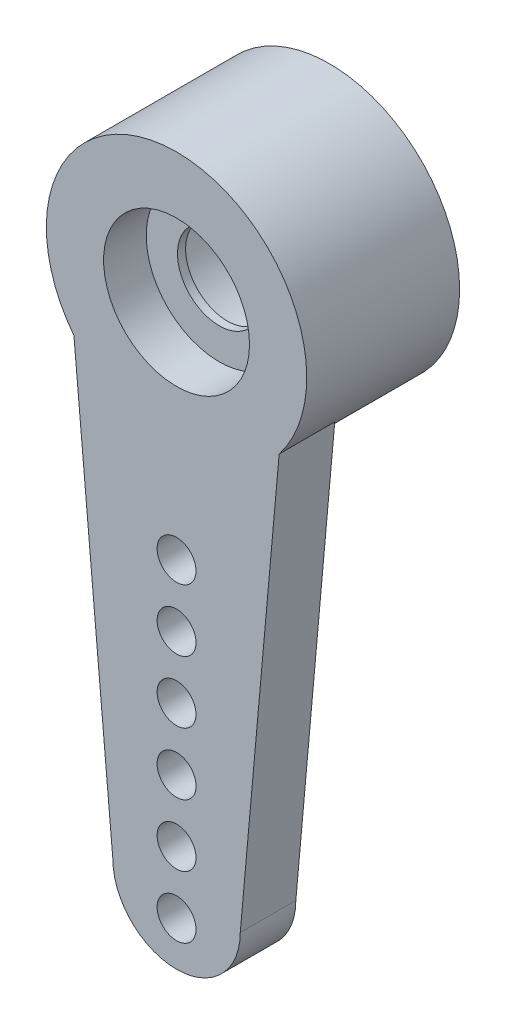
ISO-10303-21;
HEADER;
FILE_DESCRIPTION(('STEP AP214'),'2;1');
FILE_NAME('part.step','',(''),(''),'','','');
FILE_SCHEMA(('AUTOMOTIVE_DESIGN { 1 0 10303 214 1 1 1 1 }'));
ENDSEC;
DATA;
#1=APPLICATION_CONTEXT('core data for automotive mechanical design processes');
#2=APPLICATION_PROTOCOL_DEFINITION('international standard','automotive_design',2000,#1);
#3=PRODUCT_CONTEXT('',#1,'mechanical');
#4=PRODUCT('Part','Part','',(#3));
#5=PRODUCT_RELATED_PRODUCT_CATEGORY('part','',(#4));
#6=PRODUCT_DEFINITION_FORMATION('','',#4);
#7=PRODUCT_DEFINITION_CONTEXT('part definition',#1,'design');
#8=PRODUCT_DEFINITION('design','',#6,#7);
#9=PRODUCT_DEFINITION_SHAPE('','',#8);
#10=(LENGTH_UNIT() NAMED_UNIT(*) SI_UNIT(.MILLI.,.METRE.));
#11=(NAMED_UNIT(*) PLANE_ANGLE_UNIT() SI_UNIT($,.RADIAN.));
#12=(NAMED_UNIT(*) SI_UNIT($,.STERADIAN.) SOLID_ANGLE_UNIT());
#13=UNCERTAINTY_MEASURE_WITH_UNIT(LENGTH_MEASURE(1.E-05),#10,'distance_accuracy_value','');
#14=(GEOMETRIC_REPRESENTATION_CONTEXT(3) GLOBAL_UNCERTAINTY_ASSIGNED_CONTEXT((#13)) GLOBAL_UNIT_ASSIGNED_CONTEXT((#10,
#11,#12)) REPRESENTATION_CONTEXT('',''));
#15=CARTESIAN_POINT('',(0.,0.,0.));
#16=DIRECTION('',(0.,0.,1.));
#17=DIRECTION('',(1.,0.,0.));
#18=AXIS2_PLACEMENT_3D('',#15,#16,#17);
#19=CARTESIAN_POINT('',(-5.49999999999997,0.,-2.84196586235089));
#20=DIRECTION('',(0.,0.,-1.));
#21=DIRECTION('',(-1.,0.,0.));
#22=AXIS2_PLACEMENT_3D('',#19,#20,#21);
#23=CYLINDRICAL_SURFACE('',#22,2.);
#24=CARTESIAN_POINT('',(-5.49999999999997,0.,-7.03296586235089));
#25=DIRECTION('',(0.,0.,1.));
#26=DIRECTION('',(1.,0.,0.));
#27=AXIS2_PLACEMENT_3D('',#24,#25,#26);
#28=CIRCLE('',#27,2.);
#29=CARTESIAN_POINT('',(-3.49999999999996,0.,-7.03296586235089));
#30=VERTEX_POINT('',#29);
#31=EDGE_CURVE('E111',#30,#30,#28,.T.);
#32=ORIENTED_EDGE('',*,*,#31,.F.);
#33=EDGE_LOOP('',(#32));
#34=FACE_BOUND('',#33,.T.);
#35=CARTESIAN_POINT('',(-5.49999999999997,0.,-4.23296586235089));
#36=DIRECTION('',(0.,0.,1.));
#37=DIRECTION('',(1.,0.,0.));
#38=AXIS2_PLACEMENT_3D('',#35,#36,#37);
#39=CIRCLE('',#38,2.00000000000001);
#40=CARTESIAN_POINT('',(-3.49999999999996,0.,-4.23296586235089));
#41=VERTEX_POINT('',#40);
#42=EDGE_CURVE('E107',#41,#41,#39,.T.);
#43=ORIENTED_EDGE('',*,*,#42,.T.);
#44=EDGE_LOOP('',(#43));
#45=FACE_BOUND('',#44,.T.);
#46=ADVANCED_FACE('F34',(#34,#45),#23,.F.);
#47=CARTESIAN_POINT('',(-5.49999999999997,0.,-2.84196586235089));
#48=DIRECTION('',(0.,0.,1.));
#49=DIRECTION('',(1.,0.,0.));
#50=AXIS2_PLACEMENT_3D('',#47,#48,#49);
#51=PLANE('',#50);
#52=CARTESIAN_POINT('',(-5.49999999999997,0.,-2.84196586235089));
#53=DIRECTION('',(0.,0.,1.));
#54=DIRECTION('',(1.,0.,0.));
#55=AXIS2_PLACEMENT_3D('',#52,#53,#54);
#56=CIRCLE('',#55,3.5687);
#57=CARTESIAN_POINT('',(-2.68694999999995,-2.19598938692788,-2.84196586235089));
#58=VERTEX_POINT('',#57);
#59=CARTESIAN_POINT('',(-8.31304999999995,-2.1959893869279,-2.84196586235089));
#60=VERTEX_POINT('',#59);
#61=EDGE_CURVE('E42',#58,#60,#56,.T.);
#62=ORIENTED_EDGE('',*,*,#61,.T.);
#63=DIRECTION('',(0.0893287482023586,-0.996002196154506,0.));
#64=VECTOR('',#63,1.);
#65=CARTESIAN_POINT('',(-7.24624999999995,-14.09065,-2.84196586235089));
#66=LINE('',#65,#64);
#67=CARTESIAN_POINT('',(-7.24624999999995,-14.09065,-2.84196586235089));
#68=VERTEX_POINT('',#67);
#69=EDGE_CURVE('E195',#60,#68,#66,.T.);
#70=ORIENTED_EDGE('',*,*,#69,.T.);
#71=CARTESIAN_POINT('',(-5.49999999999995,-14.09065,-2.84196586235089));
#72=DIRECTION('',(0.,0.,1.));
#73=DIRECTION('',(1.,0.,0.));
#74=AXIS2_PLACEMENT_3D('',#71,#72,#73);
#75=CIRCLE('',#74,1.74625);
#76=CARTESIAN_POINT('',(-3.75374999999995,-14.09065,-2.84196586235089));
#77=VERTEX_POINT('',#76);
#78=EDGE_CURVE('E189',#68,#77,#75,.T.);
#79=ORIENTED_EDGE('',*,*,#78,.T.);
#80=DIRECTION('',(0.0893287482023584,0.996002196154506,0.));
#81=VECTOR('',#80,1.);
#82=CARTESIAN_POINT('',(-3.75374999999995,-14.09065,-2.84196586235089));
#83=LINE('',#82,#81);
#84=EDGE_CURVE('E49',#77,#58,#83,.T.);
#85=ORIENTED_EDGE('',*,*,#84,.T.);
#86=EDGE_LOOP('',(#62,#70,#79,#85));
#87=FACE_BOUND('',#86,.T.);
#88=CARTESIAN_POINT('',(-5.49999999999997,0.,-2.84196586235089));
#89=DIRECTION('',(0.,0.,1.));
#90=DIRECTION('',(1.,0.,0.));
#91=AXIS2_PLACEMENT_3D('',#88,#89,#90);
#92=CIRCLE('',#91,2.);
#93=CARTESIAN_POINT('',(-3.49999999999996,0.,-2.84196586235089));
#94=VERTEX_POINT('',#93);
#95=EDGE_CURVE('E114',#94,#94,#92,.T.);
#96=ORIENTED_EDGE('',*,*,#95,.F.);
#97=EDGE_LOOP('',(#96));
#98=FACE_BOUND('',#97,.T.);
#99=CARTESIAN_POINT('',(-5.49999999999998,-6.11505,-2.84196586235089));
#100=DIRECTION('',(0.,0.,1.));
#101=DIRECTION('',(1.,0.,0.));
#102=AXIS2_PLACEMENT_3D('',#99,#100,#101);
#103=CIRCLE('',#102,0.533399999999999);
#104=CARTESIAN_POINT('',(-4.96659999999998,-6.11505,-2.84196586235089));
#105=VERTEX_POINT('',#104);
#106=EDGE_CURVE('E164',#105,#105,#103,.T.);
#107=ORIENTED_EDGE('',*,*,#106,.F.);
#108=EDGE_LOOP('',(#107));
#109=FACE_BOUND('',#108,.T.);
#110=CARTESIAN_POINT('',(-5.49999999999997,-7.81685,-2.84196586235089));
#111=DIRECTION('',(0.,0.,1.));
#112=DIRECTION('',(1.,0.,0.));
#113=AXIS2_PLACEMENT_3D('',#110,#111,#112);
#114=CIRCLE('',#113,0.533399999999999);
#115=CARTESIAN_POINT('',(-4.96659999999998,-7.81685,-2.84196586235089));
#116=VERTEX_POINT('',#115);
#117=EDGE_CURVE('E168',#116,#116,#114,.T.);
#118=ORIENTED_EDGE('',*,*,#117,.F.);
#119=EDGE_LOOP('',(#118));
#120=FACE_BOUND('',#119,.T.);
#121=CARTESIAN_POINT('',(-5.49999999999997,-9.51865,-2.84196586235089));
#122=DIRECTION('',(0.,0.,1.));
#123=DIRECTION('',(1.,0.,0.));
#124=AXIS2_PLACEMENT_3D('',#121,#122,#123);
#125=CIRCLE('',#124,0.5334);
#126=CARTESIAN_POINT('',(-4.96659999999997,-9.51865,-2.84196586235089));
#127=VERTEX_POINT('',#126);
#128=EDGE_CURVE('E172',#127,#127,#125,.T.);
#129=ORIENTED_EDGE('',*,*,#128,.F.);
#130=EDGE_LOOP('',(#129));
#131=FACE_BOUND('',#130,.T.);
#132=CARTESIAN_POINT('',(-5.49999999999996,-11.22045,-2.84196586235089));
#133=DIRECTION('',(0.,0.,1.));
#134=DIRECTION('',(1.,0.,0.));
#135=AXIS2_PLACEMENT_3D('',#132,#133,#134);
#136=CIRCLE('',#135,0.5334);
#137=CARTESIAN_POINT('',(-4.96659999999996,-11.22045,-2.84196586235089));
#138=VERTEX_POINT('',#137);
#139=EDGE_CURVE('E176',#138,#138,#136,.T.);
#140=ORIENTED_EDGE('',*,*,#139,.F.);
#141=EDGE_LOOP('',(#140));
#142=FACE_BOUND('',#141,.T.);
#143=CARTESIAN_POINT('',(-5.49999999999996,-12.92225,-2.84196586235089));
#144=DIRECTION('',(0.,0.,1.));
#145=DIRECTION('',(1.,0.,0.));
#146=AXIS2_PLACEMENT_3D('',#143,#144,#145);
#147=CIRCLE('',#146,0.5334);
#148=CARTESIAN_POINT('',(-4.96659999999996,-12.92225,-2.84196586235089));
#149=VERTEX_POINT('',#148);
#150=EDGE_CURVE('E180',#149,#149,#147,.T.);
#151=ORIENTED_EDGE('',*,*,#150,.F.);
#152=EDGE_LOOP('',(#151));
#153=FACE_BOUND('',#152,.T.);
#154=CARTESIAN_POINT('',(-5.49999999999995,-14.62405,-2.84196586235089));
#155=DIRECTION('',(0.,0.,1.));
#156=DIRECTION('',(1.,0.,0.));
#157=AXIS2_PLACEMENT_3D('',#154,#155,#156);
#158=CIRCLE('',#157,0.5334);
#159=CARTESIAN_POINT('',(-4.96659999999995,-14.62405,-2.84196586235089));
#160=VERTEX_POINT('',#159);
#161=EDGE_CURVE('E183',#160,#160,#158,.T.);
#162=ORIENTED_EDGE('',*,*,#161,.F.);
#163=EDGE_LOOP('',(#162));
#164=FACE_BOUND('',#163,.T.);
#165=ADVANCED_FACE('F126',(#87,#98,#109,#120,#131,#142,#153,#164),#51,.T.);
#166=CARTESIAN_POINT('',(-5.49999999999997,0.,-7.03296586235089));
#167=DIRECTION('',(0.,0.,1.));
#168=DIRECTION('',(1.,0.,0.));
#169=AXIS2_PLACEMENT_3D('',#166,#167,#168);
#170=PLANE('',#169);
#171=CARTESIAN_POINT('',(-5.49999999999997,0.,-7.03296586235089));
#172=DIRECTION('',(0.,0.,1.));
#173=DIRECTION('',(1.,0.,0.));
#174=AXIS2_PLACEMENT_3D('',#171,#172,#173);
#175=CIRCLE('',#174,3.5687);
#176=CARTESIAN_POINT('',(-1.93129999999997,0.,-7.03296586235089));
#177=VERTEX_POINT('',#176);
#178=EDGE_CURVE('E117',#177,#177,#175,.T.);
#179=ORIENTED_EDGE('',*,*,#178,.F.);
#180=EDGE_LOOP('',(#179));
#181=FACE_BOUND('',#180,.T.);
#182=ORIENTED_EDGE('',*,*,#31,.T.);
#183=EDGE_LOOP('',(#182));
#184=FACE_BOUND('',#183,.T.);
#185=ADVANCED_FACE('F123',(#181,#184),#170,.F.);
#186=CARTESIAN_POINT('',(-5.49999999999997,0.,-2.84196586235089));
#187=DIRECTION('',(0.,0.,-1.));
#188=DIRECTION('',(-1.,0.,0.));
#189=AXIS2_PLACEMENT_3D('',#186,#187,#188);
#190=CYLINDRICAL_SURFACE('',#189,3.5687);
#191=CARTESIAN_POINT('',(-5.49999999999995,0.,-4.36596586235089));
#192=DIRECTION('',(0.,0.,-1.));
#193=DIRECTION('',(-1.,0.,0.));
#194=AXIS2_PLACEMENT_3D('',#191,#192,#193);
#195=CIRCLE('',#194,3.5687);
#196=CARTESIAN_POINT('',(-2.68694999999995,-2.1959893869279,-4.36596586235089));
#197=VERTEX_POINT('',#196);
#198=CARTESIAN_POINT('',(-8.31304999999995,-2.1959893869279,-4.36596586235089));
#199=VERTEX_POINT('',#198);
#200=EDGE_CURVE('E84',#197,#199,#195,.T.);
#201=ORIENTED_EDGE('',*,*,#200,.T.);
#202=DIRECTION('',(0.,0.,1.));
#203=VECTOR('',#202,1.);
#204=CARTESIAN_POINT('',(-8.31304999999995,-2.1959893869279,-4.36596586235089));
#205=LINE('',#204,#203);
#206=EDGE_CURVE('E98',#199,#60,#205,.T.);
#207=ORIENTED_EDGE('',*,*,#206,.T.);
#208=ORIENTED_EDGE('',*,*,#61,.F.);
#209=DIRECTION('',(0.,0.,1.));
#210=VECTOR('',#209,1.);
#211=CARTESIAN_POINT('',(-2.68694999999995,-2.1959893869279,-4.36596586235089));
#212=LINE('',#211,#210);
#213=EDGE_CURVE('E93',#197,#58,#212,.T.);
#214=ORIENTED_EDGE('',*,*,#213,.F.);
#215=EDGE_LOOP('',(#201,#207,#208,#214));
#216=FACE_BOUND('',#215,.T.);
#217=ORIENTED_EDGE('',*,*,#178,.T.);
#218=EDGE_LOOP('',(#217));
#219=FACE_BOUND('',#218,.T.);
#220=ADVANCED_FACE('F36',(#216,#219),#190,.T.);
#221=CARTESIAN_POINT('',(-5.49999999999997,0.,-4.01036586235089));
#222=DIRECTION('',(0.,0.,1.));
#223=DIRECTION('',(1.,0.,0.));
#224=AXIS2_PLACEMENT_3D('',#221,#222,#223);
#225=CIRCLE('',#224,2.);
#226=CARTESIAN_POINT('',(-3.49999999999996,0.,-4.01036586235089));
#227=VERTEX_POINT('',#226);
#228=EDGE_CURVE('E12',#227,#227,#225,.T.);
#229=ORIENTED_EDGE('',*,*,#228,.F.);
#230=EDGE_LOOP('',(#229));
#231=FACE_BOUND('',#230,.T.);
#232=ORIENTED_EDGE('',*,*,#95,.T.);
#233=EDGE_LOOP('',(#232));
#234=FACE_BOUND('',#233,.T.);
#235=ADVANCED_FACE('F132',(#231,#234),#23,.F.);
#236=CARTESIAN_POINT('',(-5.49999999999997,0.,-4.23296586235089));
#237=DIRECTION('',(0.,0.,1.));
#238=DIRECTION('',(1.,0.,0.));
#239=AXIS2_PLACEMENT_3D('',#236,#237,#238);
#240=PLANE('',#239);
#241=ORIENTED_EDGE('',*,*,#42,.F.);
#242=EDGE_LOOP('',(#241));
#243=FACE_BOUND('',#242,.T.);
#244=CARTESIAN_POINT('',(-5.49999999999997,0.,-4.23296586235089));
#245=DIRECTION('',(0.,0.,1.));
#246=DIRECTION('',(1.,0.,0.));
#247=AXIS2_PLACEMENT_3D('',#244,#245,#246);
#248=CIRCLE('',#247,1.14300000000001);
#249=CARTESIAN_POINT('',(-4.35699999999996,0.,-4.23296586235089));
#250=VERTEX_POINT('',#249);
#251=EDGE_CURVE('E104',#250,#250,#248,.T.);
#252=ORIENTED_EDGE('',*,*,#251,.T.);
#253=EDGE_LOOP('',(#252));
#254=FACE_BOUND('',#253,.T.);
#255=ADVANCED_FACE('F135',(#243,#254),#240,.F.);
#256=CARTESIAN_POINT('',(-5.49999999999997,0.,2.81488838714151));
#257=DIRECTION('',(0.,0.,-1.));
#258=DIRECTION('',(-1.,0.,0.));
#259=AXIS2_PLACEMENT_3D('',#256,#257,#258);
#260=CYLINDRICAL_SURFACE('',#259,1.14300000000001);
#261=ORIENTED_EDGE('',*,*,#251,.F.);
#262=EDGE_LOOP('',(#261));
#263=FACE_BOUND('',#262,.T.);
#264=CARTESIAN_POINT('',(-5.49999999999997,0.,-4.01036586235089));
#265=DIRECTION('',(0.,0.,1.));
#266=DIRECTION('',(1.,0.,0.));
#267=AXIS2_PLACEMENT_3D('',#264,#265,#266);
#268=CIRCLE('',#267,1.14300000000001);
#269=CARTESIAN_POINT('',(-4.35699999999996,0.,-4.01036586235089));
#270=VERTEX_POINT('',#269);
#271=EDGE_CURVE('E108',#270,#270,#268,.T.);
#272=ORIENTED_EDGE('',*,*,#271,.T.);
#273=EDGE_LOOP('',(#272));
#274=FACE_BOUND('',#273,.T.);
#275=ADVANCED_FACE('F138',(#263,#274),#260,.F.);
#276=CARTESIAN_POINT('',(-5.49999999999997,0.,-4.01036586235089));
#277=DIRECTION('',(0.,0.,1.));
#278=DIRECTION('',(1.,0.,0.));
#279=AXIS2_PLACEMENT_3D('',#276,#277,#278);
#280=PLANE('',#279);
#281=ORIENTED_EDGE('',*,*,#271,.F.);
#282=EDGE_LOOP('',(#281));
#283=FACE_BOUND('',#282,.T.);
#284=ORIENTED_EDGE('',*,*,#228,.T.);
#285=EDGE_LOOP('',(#284));
#286=FACE_BOUND('',#285,.T.);
#287=ADVANCED_FACE('F144',(#283,#286),#280,.T.);
#288=CARTESIAN_POINT('',(-5.49999999999995,-14.09065,-4.36596586235089));
#289=DIRECTION('',(0.,0.,1.));
#290=DIRECTION('',(1.,0.,0.));
#291=AXIS2_PLACEMENT_3D('',#288,#289,#290);
#292=CYLINDRICAL_SURFACE('',#291,1.74625);
#293=ORIENTED_EDGE('',*,*,#78,.F.);
#294=DIRECTION('',(0.,0.,1.));
#295=VECTOR('',#294,1.);
#296=CARTESIAN_POINT('',(-7.24624999999995,-14.09065,-4.36596586235089));
#297=LINE('',#296,#295);
#298=CARTESIAN_POINT('',(-7.24624999999995,-14.09065,-4.36596586235089));
#299=VERTEX_POINT('',#298);
#300=EDGE_CURVE('E58',#299,#68,#297,.T.);
#301=ORIENTED_EDGE('',*,*,#300,.F.);
#302=CARTESIAN_POINT('',(-5.49999999999995,-14.09065,-4.36596586235089));
#303=DIRECTION('',(0.,0.,1.));
#304=DIRECTION('',(1.,0.,0.));
#305=AXIS2_PLACEMENT_3D('',#302,#303,#304);
#306=CIRCLE('',#305,1.74625);
#307=CARTESIAN_POINT('',(-3.75374999999995,-14.09065,-4.36596586235089));
#308=VERTEX_POINT('',#307);
#309=EDGE_CURVE('E95',#299,#308,#306,.T.);
#310=ORIENTED_EDGE('',*,*,#309,.T.);
#311=DIRECTION('',(0.,0.,1.));
#312=VECTOR('',#311,1.);
#313=CARTESIAN_POINT('',(-3.75374999999995,-14.09065,-4.36596586235089));
#314=LINE('',#313,#312);
#315=EDGE_CURVE('E78',#308,#77,#314,.T.);
#316=ORIENTED_EDGE('',*,*,#315,.T.);
#317=EDGE_LOOP('',(#293,#301,#310,#316));
#318=FACE_BOUND('',#317,.T.);
#319=ADVANCED_FACE('F150',(#318),#292,.T.);
#320=CARTESIAN_POINT('',(-7.24624999999995,-14.09065,-4.36596586235089));
#321=DIRECTION('',(-0.996002196154506,-0.0893287482023586,0.));
#322=DIRECTION('',(0.0893287482023586,-0.996002196154506,0.));
#323=AXIS2_PLACEMENT_3D('',#320,#321,#322);
#324=PLANE('',#323);
#325=ORIENTED_EDGE('',*,*,#69,.F.);
#326=ORIENTED_EDGE('',*,*,#206,.F.);
#327=DIRECTION('',(0.0893287482023586,-0.996002196154506,0.));
#328=VECTOR('',#327,1.);
#329=CARTESIAN_POINT('',(-7.24624999999995,-14.09065,-4.36596586235089));
#330=LINE('',#329,#328);
#331=EDGE_CURVE('E87',#199,#299,#330,.T.);
#332=ORIENTED_EDGE('',*,*,#331,.T.);
#333=ORIENTED_EDGE('',*,*,#300,.T.);
#334=EDGE_LOOP('',(#325,#326,#332,#333));
#335=FACE_BOUND('',#334,.T.);
#336=ADVANCED_FACE('F201',(#335),#324,.T.);
#337=CARTESIAN_POINT('',(-3.75374999999995,-14.09065,-4.36596586235089));
#338=DIRECTION('',(0.996002196154506,-0.0893287482023584,0.));
#339=DIRECTION('',(0.0893287482023584,0.996002196154506,0.));
#340=AXIS2_PLACEMENT_3D('',#337,#338,#339);
#341=PLANE('',#340);
#342=ORIENTED_EDGE('',*,*,#84,.F.);
#343=ORIENTED_EDGE('',*,*,#315,.F.);
#344=DIRECTION('',(0.0893287482023584,0.996002196154506,0.));
#345=VECTOR('',#344,1.);
#346=CARTESIAN_POINT('',(-3.75374999999995,-14.09065,-4.36596586235089));
#347=LINE('',#346,#345);
#348=EDGE_CURVE('E86',#308,#197,#347,.T.);
#349=ORIENTED_EDGE('',*,*,#348,.T.);
#350=ORIENTED_EDGE('',*,*,#213,.T.);
#351=EDGE_LOOP('',(#342,#343,#349,#350));
#352=FACE_BOUND('',#351,.T.);
#353=ADVANCED_FACE('F92',(#352),#341,.T.);
#354=CARTESIAN_POINT('',(-5.49999999999995,-14.09065,-4.36596586235089));
#355=DIRECTION('',(0.,0.,1.));
#356=DIRECTION('',(1.,0.,0.));
#357=AXIS2_PLACEMENT_3D('',#354,#355,#356);
#358=PLANE('',#357);
#359=CARTESIAN_POINT('',(-5.49999999999998,-6.11505,-4.36596586235089));
#360=DIRECTION('',(0.,0.,1.));
#361=DIRECTION('',(1.,0.,0.));
#362=AXIS2_PLACEMENT_3D('',#359,#360,#361);
#363=CIRCLE('',#362,0.533399999999999);
#364=CARTESIAN_POINT('',(-4.96659999999998,-6.11505,-4.36596586235089));
#365=VERTEX_POINT('',#364);
#366=EDGE_CURVE('E242',#365,#365,#363,.T.);
#367=ORIENTED_EDGE('',*,*,#366,.T.);
#368=EDGE_LOOP('',(#367));
#369=FACE_BOUND('',#368,.T.);
#370=CARTESIAN_POINT('',(-5.49999999999997,-7.81685,-4.36596586235089));
#371=DIRECTION('',(0.,0.,1.));
#372=DIRECTION('',(1.,0.,0.));
#373=AXIS2_PLACEMENT_3D('',#370,#371,#372);
#374=CIRCLE('',#373,0.533399999999999);
#375=CARTESIAN_POINT('',(-4.96659999999998,-7.81685,-4.36596586235089));
#376=VERTEX_POINT('',#375);
#377=EDGE_CURVE('E246',#376,#376,#374,.T.);
#378=ORIENTED_EDGE('',*,*,#377,.T.);
#379=EDGE_LOOP('',(#378));
#380=FACE_BOUND('',#379,.T.);
#381=CARTESIAN_POINT('',(-5.49999999999997,-9.51865,-4.36596586235089));
#382=DIRECTION('',(0.,0.,1.));
#383=DIRECTION('',(1.,0.,0.));
#384=AXIS2_PLACEMENT_3D('',#381,#382,#383);
#385=CIRCLE('',#384,0.5334);
#386=CARTESIAN_POINT('',(-4.96659999999997,-9.51865,-4.36596586235089));
#387=VERTEX_POINT('',#386);
#388=EDGE_CURVE('E250',#387,#387,#385,.T.);
#389=ORIENTED_EDGE('',*,*,#388,.T.);
#390=EDGE_LOOP('',(#389));
#391=FACE_BOUND('',#390,.T.);
#392=CARTESIAN_POINT('',(-5.49999999999996,-11.22045,-4.36596586235089));
#393=DIRECTION('',(0.,0.,1.));
#394=DIRECTION('',(1.,0.,0.));
#395=AXIS2_PLACEMENT_3D('',#392,#393,#394);
#396=CIRCLE('',#395,0.5334);
#397=CARTESIAN_POINT('',(-4.96659999999996,-11.22045,-4.36596586235089));
#398=VERTEX_POINT('',#397);
#399=EDGE_CURVE('E254',#398,#398,#396,.T.);
#400=ORIENTED_EDGE('',*,*,#399,.T.);
#401=EDGE_LOOP('',(#400));
#402=FACE_BOUND('',#401,.T.);
#403=CARTESIAN_POINT('',(-5.49999999999996,-12.92225,-4.36596586235089));
#404=DIRECTION('',(0.,0.,1.));
#405=DIRECTION('',(1.,0.,0.));
#406=AXIS2_PLACEMENT_3D('',#403,#404,#405);
#407=CIRCLE('',#406,0.5334);
#408=CARTESIAN_POINT('',(-4.96659999999996,-12.92225,-4.36596586235089));
#409=VERTEX_POINT('',#408);
#410=EDGE_CURVE('E186',#409,#409,#407,.T.);
#411=ORIENTED_EDGE('',*,*,#410,.T.);
#412=EDGE_LOOP('',(#411));
#413=FACE_BOUND('',#412,.T.);
#414=CARTESIAN_POINT('',(-5.49999999999995,-14.62405,-4.36596586235089));
#415=DIRECTION('',(0.,0.,1.));
#416=DIRECTION('',(1.,0.,0.));
#417=AXIS2_PLACEMENT_3D('',#414,#415,#416);
#418=CIRCLE('',#417,0.5334);
#419=CARTESIAN_POINT('',(-4.96659999999995,-14.62405,-4.36596586235089));
#420=VERTEX_POINT('',#419);
#421=EDGE_CURVE('E185',#420,#420,#418,.T.);
#422=ORIENTED_EDGE('',*,*,#421,.T.);
#423=EDGE_LOOP('',(#422));
#424=FACE_BOUND('',#423,.T.);
#425=ORIENTED_EDGE('',*,*,#309,.F.);
#426=ORIENTED_EDGE('',*,*,#331,.F.);
#427=ORIENTED_EDGE('',*,*,#200,.F.);
#428=ORIENTED_EDGE('',*,*,#348,.F.);
#429=EDGE_LOOP('',(#425,#426,#427,#428));
#430=FACE_BOUND('',#429,.T.);
#431=ADVANCED_FACE('F85',(#369,#380,#391,#402,#413,#424,#430),#358,.F.);
#432=CARTESIAN_POINT('',(-5.49999999999995,-14.62405,-4.36596586235089));
#433=DIRECTION('',(0.,0.,1.));
#434=DIRECTION('',(1.,0.,0.));
#435=AXIS2_PLACEMENT_3D('',#432,#433,#434);
#436=CYLINDRICAL_SURFACE('',#435,0.5334);
#437=ORIENTED_EDGE('',*,*,#421,.F.);
#438=EDGE_LOOP('',(#437));
#439=FACE_BOUND('',#438,.T.);
#440=ORIENTED_EDGE('',*,*,#161,.T.);
#441=EDGE_LOOP('',(#440));
#442=FACE_BOUND('',#441,.T.);
#443=ADVANCED_FACE('F213',(#439,#442),#436,.F.);
#444=CARTESIAN_POINT('',(-5.49999999999996,-12.92225,-4.36596586235089));
#445=DIRECTION('',(0.,0.,1.));
#446=DIRECTION('',(1.,0.,0.));
#447=AXIS2_PLACEMENT_3D('',#444,#445,#446);
#448=CYLINDRICAL_SURFACE('',#447,0.5334);
#449=ORIENTED_EDGE('',*,*,#410,.F.);
#450=EDGE_LOOP('',(#449));
#451=FACE_BOUND('',#450,.T.);
#452=ORIENTED_EDGE('',*,*,#150,.T.);
#453=EDGE_LOOP('',(#452));
#454=FACE_BOUND('',#453,.T.);
#455=ADVANCED_FACE('F217',(#451,#454),#448,.F.);
#456=CARTESIAN_POINT('',(-5.49999999999996,-11.22045,-4.36596586235089));
#457=DIRECTION('',(0.,0.,1.));
#458=DIRECTION('',(1.,0.,0.));
#459=AXIS2_PLACEMENT_3D('',#456,#457,#458);
#460=CYLINDRICAL_SURFACE('',#459,0.5334);
#461=ORIENTED_EDGE('',*,*,#399,.F.);
#462=EDGE_LOOP('',(#461));
#463=FACE_BOUND('',#462,.T.);
#464=ORIENTED_EDGE('',*,*,#139,.T.);
#465=EDGE_LOOP('',(#464));
#466=FACE_BOUND('',#465,.T.);
#467=ADVANCED_FACE('F221',(#463,#466),#460,.F.);
#468=CARTESIAN_POINT('',(-5.49999999999997,-9.51865,-4.36596586235089));
#469=DIRECTION('',(0.,0.,1.));
#470=DIRECTION('',(1.,0.,0.));
#471=AXIS2_PLACEMENT_3D('',#468,#469,#470);
#472=CYLINDRICAL_SURFACE('',#471,0.5334);
#473=ORIENTED_EDGE('',*,*,#388,.F.);
#474=EDGE_LOOP('',(#473));
#475=FACE_BOUND('',#474,.T.);
#476=ORIENTED_EDGE('',*,*,#128,.T.);
#477=EDGE_LOOP('',(#476));
#478=FACE_BOUND('',#477,.T.);
#479=ADVANCED_FACE('F225',(#475,#478),#472,.F.);
#480=CARTESIAN_POINT('',(-5.49999999999997,-7.81685,-4.36596586235089));
#481=DIRECTION('',(0.,0.,1.));
#482=DIRECTION('',(1.,0.,0.));
#483=AXIS2_PLACEMENT_3D('',#480,#481,#482);
#484=CYLINDRICAL_SURFACE('',#483,0.533399999999999);
#485=ORIENTED_EDGE('',*,*,#377,.F.);
#486=EDGE_LOOP('',(#485));
#487=FACE_BOUND('',#486,.T.);
#488=ORIENTED_EDGE('',*,*,#117,.T.);
#489=EDGE_LOOP('',(#488));
#490=FACE_BOUND('',#489,.T.);
#491=ADVANCED_FACE('F229',(#487,#490),#484,.F.);
#492=CARTESIAN_POINT('',(-5.49999999999998,-6.11505,-4.36596586235089));
#493=DIRECTION('',(0.,0.,1.));
#494=DIRECTION('',(1.,0.,0.));
#495=AXIS2_PLACEMENT_3D('',#492,#493,#494);
#496=CYLINDRICAL_SURFACE('',#495,0.533399999999999);
#497=ORIENTED_EDGE('',*,*,#366,.F.);
#498=EDGE_LOOP('',(#497));
#499=FACE_BOUND('',#498,.T.);
#500=ORIENTED_EDGE('',*,*,#106,.T.);
#501=EDGE_LOOP('',(#500));
#502=FACE_BOUND('',#501,.T.);
#503=ADVANCED_FACE('F233',(#499,#502),#496,.F.);
#504=CLOSED_SHELL('',(#46,#165,#185,#220,#235,#255,#275,#287,#319,#336,#353,#431,#443,#455,#467,
#479,#491,#503));
#505=MANIFOLD_SOLID_BREP('B2',#504);
#506=ADVANCED_BREP_SHAPE_REPRESENTATION('',(#18,#505),#14);
#507=SHAPE_DEFINITION_REPRESENTATION(#9,#506);
ENDSEC;
END-ISO-10303-21;
